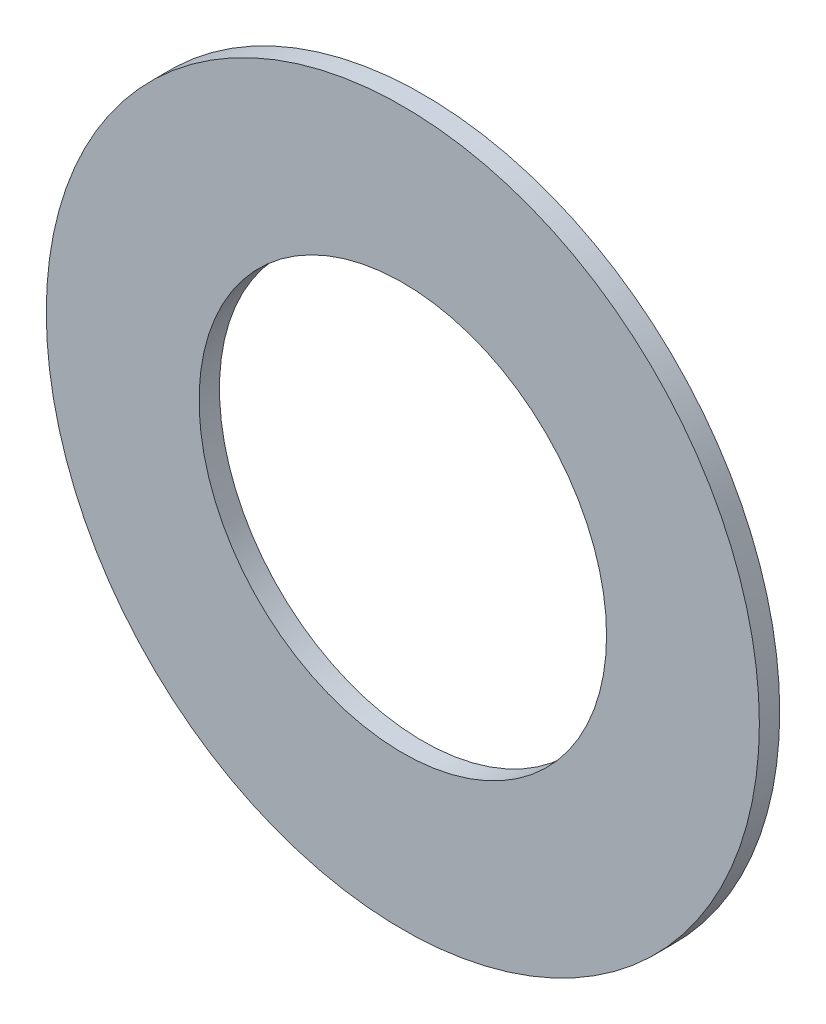
ISO-10303-21;
HEADER;
FILE_DESCRIPTION(('STEP AP214'),'2;1');
FILE_NAME('part.step','',(''),(''),'','','');
FILE_SCHEMA(('AUTOMOTIVE_DESIGN { 1 0 10303 214 1 1 1 1 }'));
ENDSEC;
DATA;
#1=APPLICATION_CONTEXT('core data for automotive mechanical design processes');
#2=APPLICATION_PROTOCOL_DEFINITION('international standard','automotive_design',2000,#1);
#3=PRODUCT_CONTEXT('',#1,'mechanical');
#4=PRODUCT('Part','Part','',(#3));
#5=PRODUCT_RELATED_PRODUCT_CATEGORY('part','',(#4));
#6=PRODUCT_DEFINITION_FORMATION('','',#4);
#7=PRODUCT_DEFINITION_CONTEXT('part definition',#1,'design');
#8=PRODUCT_DEFINITION('design','',#6,#7);
#9=PRODUCT_DEFINITION_SHAPE('','',#8);
#10=(LENGTH_UNIT() NAMED_UNIT(*) SI_UNIT(.MILLI.,.METRE.));
#11=(NAMED_UNIT(*) PLANE_ANGLE_UNIT() SI_UNIT($,.RADIAN.));
#12=(NAMED_UNIT(*) SI_UNIT($,.STERADIAN.) SOLID_ANGLE_UNIT());
#13=UNCERTAINTY_MEASURE_WITH_UNIT(LENGTH_MEASURE(1.E-05),#10,'distance_accuracy_value','');
#14=(GEOMETRIC_REPRESENTATION_CONTEXT(3) GLOBAL_UNCERTAINTY_ASSIGNED_CONTEXT((#13)) GLOBAL_UNIT_ASSIGNED_CONTEXT((#10,
#11,#12)) REPRESENTATION_CONTEXT('',''));
#15=CARTESIAN_POINT('',(0.,0.,0.));
#16=DIRECTION('',(0.,0.,1.));
#17=DIRECTION('',(1.,0.,0.));
#18=AXIS2_PLACEMENT_3D('',#15,#16,#17);
#19=CARTESIAN_POINT('',(0.,0.,1.));
#20=DIRECTION('',(0.,0.,1.));
#21=DIRECTION('',(1.,0.,0.));
#22=AXIS2_PLACEMENT_3D('',#19,#20,#21);
#23=PLANE('',#22);
#24=CARTESIAN_POINT('',(0.,0.,1.));
#25=DIRECTION('',(0.,0.,1.));
#26=DIRECTION('',(1.,0.,0.));
#27=AXIS2_PLACEMENT_3D('',#24,#25,#26);
#28=CIRCLE('',#27,17.5);
#29=CARTESIAN_POINT('',(17.5,0.,1.));
#30=VERTEX_POINT('',#29);
#31=EDGE_CURVE('E10',#30,#30,#28,.T.);
#32=ORIENTED_EDGE('',*,*,#31,.T.);
#33=EDGE_LOOP('',(#32));
#34=FACE_BOUND('',#33,.T.);
#35=CARTESIAN_POINT('',(0.,0.,1.));
#36=DIRECTION('',(0.,0.,1.));
#37=DIRECTION('',(1.,0.,0.));
#38=AXIS2_PLACEMENT_3D('',#35,#36,#37);
#39=CIRCLE('',#38,10.);
#40=CARTESIAN_POINT('',(10.,0.,1.));
#41=VERTEX_POINT('',#40);
#42=EDGE_CURVE('E56',#41,#41,#39,.T.);
#43=ORIENTED_EDGE('',*,*,#42,.F.);
#44=EDGE_LOOP('',(#43));
#45=FACE_BOUND('',#44,.T.);
#46=ADVANCED_FACE('F43',(#34,#45),#23,.T.);
#47=CARTESIAN_POINT('',(0.,0.,0.));
#48=DIRECTION('',(0.,0.,1.));
#49=DIRECTION('',(1.,0.,0.));
#50=AXIS2_PLACEMENT_3D('',#47,#48,#49);
#51=PLANE('',#50);
#52=CARTESIAN_POINT('',(0.,0.,0.));
#53=DIRECTION('',(0.,0.,1.));
#54=DIRECTION('',(1.,0.,0.));
#55=AXIS2_PLACEMENT_3D('',#52,#53,#54);
#56=CIRCLE('',#55,17.5);
#57=CARTESIAN_POINT('',(17.5,0.,0.));
#58=VERTEX_POINT('',#57);
#59=EDGE_CURVE('E47',#58,#58,#56,.T.);
#60=ORIENTED_EDGE('',*,*,#59,.F.);
#61=EDGE_LOOP('',(#60));
#62=FACE_BOUND('',#61,.T.);
#63=CARTESIAN_POINT('',(0.,0.,0.));
#64=DIRECTION('',(0.,0.,1.));
#65=DIRECTION('',(1.,0.,0.));
#66=AXIS2_PLACEMENT_3D('',#63,#64,#65);
#67=CIRCLE('',#66,10.);
#68=CARTESIAN_POINT('',(10.,0.,0.));
#69=VERTEX_POINT('',#68);
#70=EDGE_CURVE('E58',#69,#69,#67,.T.);
#71=ORIENTED_EDGE('',*,*,#70,.T.);
#72=EDGE_LOOP('',(#71));
#73=FACE_BOUND('',#72,.T.);
#74=ADVANCED_FACE('F70',(#62,#73),#51,.F.);
#75=CARTESIAN_POINT('',(0.,0.,1.));
#76=DIRECTION('',(0.,0.,-1.));
#77=DIRECTION('',(-1.,0.,0.));
#78=AXIS2_PLACEMENT_3D('',#75,#76,#77);
#79=CYLINDRICAL_SURFACE('',#78,17.5);
#80=ORIENTED_EDGE('',*,*,#31,.F.);
#81=EDGE_LOOP('',(#80));
#82=FACE_BOUND('',#81,.T.);
#83=ORIENTED_EDGE('',*,*,#59,.T.);
#84=EDGE_LOOP('',(#83));
#85=FACE_BOUND('',#84,.T.);
#86=ADVANCED_FACE('F45',(#82,#85),#79,.T.);
#87=CARTESIAN_POINT('',(0.,0.,1.));
#88=DIRECTION('',(0.,0.,-1.));
#89=DIRECTION('',(-1.,0.,0.));
#90=AXIS2_PLACEMENT_3D('',#87,#88,#89);
#91=CYLINDRICAL_SURFACE('',#90,10.);
#92=ORIENTED_EDGE('',*,*,#42,.T.);
#93=EDGE_LOOP('',(#92));
#94=FACE_BOUND('',#93,.T.);
#95=ORIENTED_EDGE('',*,*,#70,.F.);
#96=EDGE_LOOP('',(#95));
#97=FACE_BOUND('',#96,.T.);
#98=ADVANCED_FACE('F66',(#94,#97),#91,.F.);
#99=CLOSED_SHELL('',(#46,#74,#86,#98));
#100=MANIFOLD_SOLID_BREP('B2',#99);
#101=ADVANCED_BREP_SHAPE_REPRESENTATION('',(#18,#100),#14);
#102=SHAPE_DEFINITION_REPRESENTATION(#9,#101);
ENDSEC;
END-ISO-10303-21;
